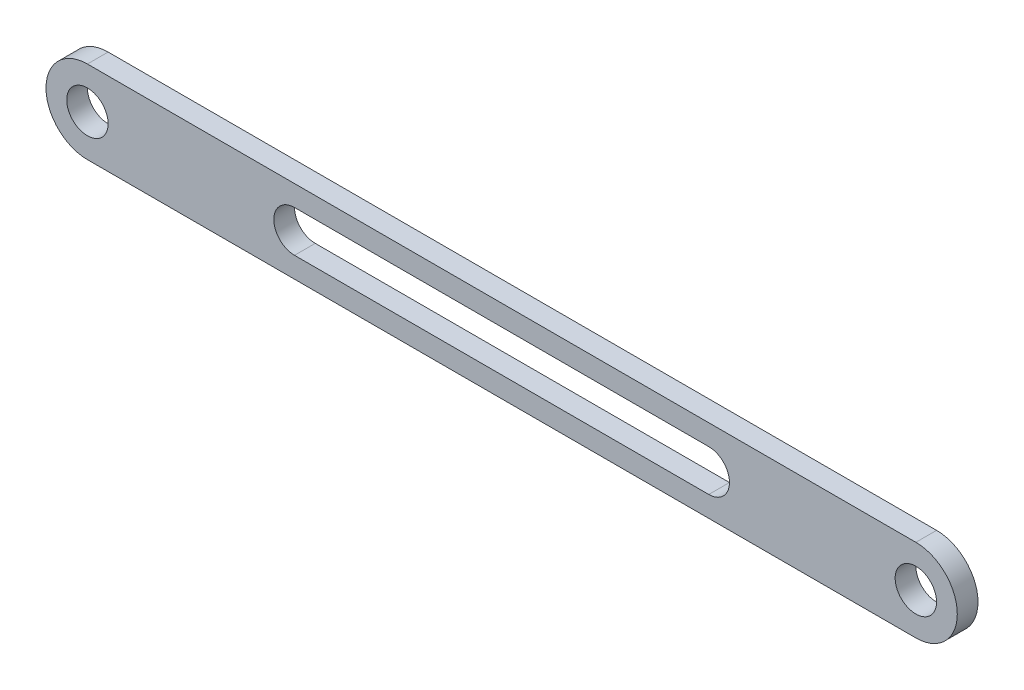
ISO-10303-21;
HEADER;
FILE_DESCRIPTION(('STEP AP214'),'2;1');
FILE_NAME('part.step','',(''),(''),'','','');
FILE_SCHEMA(('AUTOMOTIVE_DESIGN { 1 0 10303 214 1 1 1 1 }'));
ENDSEC;
DATA;
#1=APPLICATION_CONTEXT('core data for automotive mechanical design processes');
#2=APPLICATION_PROTOCOL_DEFINITION('international standard','automotive_design',2000,#1);
#3=PRODUCT_CONTEXT('',#1,'mechanical');
#4=PRODUCT('Part','Part','',(#3));
#5=PRODUCT_RELATED_PRODUCT_CATEGORY('part','',(#4));
#6=PRODUCT_DEFINITION_FORMATION('','',#4);
#7=PRODUCT_DEFINITION_CONTEXT('part definition',#1,'design');
#8=PRODUCT_DEFINITION('design','',#6,#7);
#9=PRODUCT_DEFINITION_SHAPE('','',#8);
#10=(LENGTH_UNIT() NAMED_UNIT(*) SI_UNIT(.MILLI.,.METRE.));
#11=(NAMED_UNIT(*) PLANE_ANGLE_UNIT() SI_UNIT($,.RADIAN.));
#12=(NAMED_UNIT(*) SI_UNIT($,.STERADIAN.) SOLID_ANGLE_UNIT());
#13=UNCERTAINTY_MEASURE_WITH_UNIT(LENGTH_MEASURE(1.E-05),#10,'distance_accuracy_value','');
#14=(GEOMETRIC_REPRESENTATION_CONTEXT(3) GLOBAL_UNCERTAINTY_ASSIGNED_CONTEXT((#13)) GLOBAL_UNIT_ASSIGNED_CONTEXT((#10,
#11,#12)) REPRESENTATION_CONTEXT('',''));
#15=CARTESIAN_POINT('',(0.,0.,0.));
#16=DIRECTION('',(0.,0.,1.));
#17=DIRECTION('',(1.,0.,0.));
#18=AXIS2_PLACEMENT_3D('',#15,#16,#17);
#19=CARTESIAN_POINT('',(-89.5193419963546,0.,10.));
#20=DIRECTION('',(0.,0.,1.));
#21=DIRECTION('',(1.,0.,0.));
#22=AXIS2_PLACEMENT_3D('',#19,#20,#21);
#23=PLANE('',#22);
#24=CARTESIAN_POINT('',(-89.5193419963548,0.,10.));
#25=DIRECTION('',(0.,0.,1.));
#26=DIRECTION('',(1.,0.,0.));
#27=AXIS2_PLACEMENT_3D('',#24,#25,#26);
#28=CIRCLE('',#27,9.99999999999999);
#29=CARTESIAN_POINT('',(-79.5193419963548,0.,10.));
#30=VERTEX_POINT('',#29);
#31=EDGE_CURVE('E135',#30,#30,#28,.T.);
#32=ORIENTED_EDGE('',*,*,#31,.F.);
#33=EDGE_LOOP('',(#32));
#34=FACE_BOUND('',#33,.T.);
#35=CARTESIAN_POINT('',(-89.5193419963546,0.,10.));
#36=DIRECTION('',(0.,0.,1.));
#37=DIRECTION('',(1.,0.,0.));
#38=AXIS2_PLACEMENT_3D('',#35,#36,#37);
#39=CIRCLE('',#38,20.);
#40=CARTESIAN_POINT('',(-89.5193419963546,20.,10.));
#41=VERTEX_POINT('',#40);
#42=CARTESIAN_POINT('',(-89.5193419963546,-20.,10.));
#43=VERTEX_POINT('',#42);
#44=EDGE_CURVE('E145',#41,#43,#39,.T.);
#45=ORIENTED_EDGE('',*,*,#44,.T.);
#46=DIRECTION('',(1.,0.,0.));
#47=VECTOR('',#46,1.);
#48=CARTESIAN_POINT('',(-89.5193419963546,-20.,10.));
#49=LINE('',#48,#47);
#50=CARTESIAN_POINT('',(310.480658003645,-20.,10.));
#51=VERTEX_POINT('',#50);
#52=EDGE_CURVE('E148',#43,#51,#49,.T.);
#53=ORIENTED_EDGE('',*,*,#52,.T.);
#54=CARTESIAN_POINT('',(310.480658003645,0.,10.));
#55=DIRECTION('',(0.,0.,1.));
#56=DIRECTION('',(1.,0.,0.));
#57=AXIS2_PLACEMENT_3D('',#54,#55,#56);
#58=CIRCLE('',#57,20.);
#59=CARTESIAN_POINT('',(310.480658003645,20.0000000000001,10.));
#60=VERTEX_POINT('',#59);
#61=EDGE_CURVE('E151',#51,#60,#58,.T.);
#62=ORIENTED_EDGE('',*,*,#61,.T.);
#63=DIRECTION('',(-1.,0.,0.));
#64=VECTOR('',#63,1.);
#65=CARTESIAN_POINT('',(-89.5193419963546,20.,10.));
#66=LINE('',#65,#64);
#67=EDGE_CURVE('E153',#60,#41,#66,.T.);
#68=ORIENTED_EDGE('',*,*,#67,.T.);
#69=EDGE_LOOP('',(#45,#53,#62,#68));
#70=FACE_BOUND('',#69,.T.);
#71=DIRECTION('',(1.,0.,0.));
#72=VECTOR('',#71,1.);
#73=CARTESIAN_POINT('',(10.4806580036454,-10.,10.));
#74=LINE('',#73,#72);
#75=CARTESIAN_POINT('',(10.4806580036454,-10.,10.));
#76=VERTEX_POINT('',#75);
#77=CARTESIAN_POINT('',(210.480658003645,-10.,10.));
#78=VERTEX_POINT('',#77);
#79=EDGE_CURVE('E114',#76,#78,#74,.T.);
#80=ORIENTED_EDGE('',*,*,#79,.F.);
#81=CARTESIAN_POINT('',(10.4806580036454,0.,10.));
#82=DIRECTION('',(0.,0.,1.));
#83=DIRECTION('',(1.,0.,0.));
#84=AXIS2_PLACEMENT_3D('',#81,#82,#83);
#85=CIRCLE('',#84,10.);
#86=CARTESIAN_POINT('',(10.4806580036454,9.99999999999998,10.));
#87=VERTEX_POINT('',#86);
#88=EDGE_CURVE('E106',#87,#76,#85,.T.);
#89=ORIENTED_EDGE('',*,*,#88,.F.);
#90=DIRECTION('',(-1.,0.,0.));
#91=VECTOR('',#90,1.);
#92=CARTESIAN_POINT('',(10.4806580036454,9.99999999999998,10.));
#93=LINE('',#92,#91);
#94=CARTESIAN_POINT('',(210.480658003645,10.,10.));
#95=VERTEX_POINT('',#94);
#96=EDGE_CURVE('E129',#95,#87,#93,.T.);
#97=ORIENTED_EDGE('',*,*,#96,.F.);
#98=CARTESIAN_POINT('',(210.480658003645,0.,10.));
#99=DIRECTION('',(0.,0.,1.));
#100=DIRECTION('',(1.,0.,0.));
#101=AXIS2_PLACEMENT_3D('',#98,#99,#100);
#102=CIRCLE('',#101,10.);
#103=EDGE_CURVE('E127',#78,#95,#102,.T.);
#104=ORIENTED_EDGE('',*,*,#103,.F.);
#105=EDGE_LOOP('',(#80,#89,#97,#104));
#106=FACE_BOUND('',#105,.T.);
#107=CARTESIAN_POINT('',(310.480658003645,0.,10.));
#108=DIRECTION('',(0.,0.,1.));
#109=DIRECTION('',(1.,0.,0.));
#110=AXIS2_PLACEMENT_3D('',#107,#108,#109);
#111=CIRCLE('',#110,10.);
#112=CARTESIAN_POINT('',(320.480658003645,0.,10.));
#113=VERTEX_POINT('',#112);
#114=EDGE_CURVE('E236',#113,#113,#111,.T.);
#115=ORIENTED_EDGE('',*,*,#114,.F.);
#116=EDGE_LOOP('',(#115));
#117=FACE_BOUND('',#116,.T.);
#118=ADVANCED_FACE('F41',(#34,#70,#106,#117),#23,.T.);
#119=CARTESIAN_POINT('',(-89.5193419963546,0.,0.));
#120=DIRECTION('',(0.,0.,1.));
#121=DIRECTION('',(1.,0.,0.));
#122=AXIS2_PLACEMENT_3D('',#119,#120,#121);
#123=PLANE('',#122);
#124=CARTESIAN_POINT('',(-89.5193419963548,0.,0.));
#125=DIRECTION('',(0.,0.,1.));
#126=DIRECTION('',(1.,0.,0.));
#127=AXIS2_PLACEMENT_3D('',#124,#125,#126);
#128=CIRCLE('',#127,9.99999999999999);
#129=CARTESIAN_POINT('',(-79.5193419963548,0.,0.));
#130=VERTEX_POINT('',#129);
#131=EDGE_CURVE('E242',#130,#130,#128,.T.);
#132=ORIENTED_EDGE('',*,*,#131,.T.);
#133=EDGE_LOOP('',(#132));
#134=FACE_BOUND('',#133,.T.);
#135=CARTESIAN_POINT('',(-89.5193419963546,0.,0.));
#136=DIRECTION('',(0.,0.,1.));
#137=DIRECTION('',(1.,0.,0.));
#138=AXIS2_PLACEMENT_3D('',#135,#136,#137);
#139=CIRCLE('',#138,20.);
#140=CARTESIAN_POINT('',(-89.5193419963546,20.,0.));
#141=VERTEX_POINT('',#140);
#142=CARTESIAN_POINT('',(-89.5193419963546,-20.,0.));
#143=VERTEX_POINT('',#142);
#144=EDGE_CURVE('E122',#141,#143,#139,.T.);
#145=ORIENTED_EDGE('',*,*,#144,.F.);
#146=DIRECTION('',(-1.,0.,0.));
#147=VECTOR('',#146,1.);
#148=CARTESIAN_POINT('',(-89.5193419963546,20.,0.));
#149=LINE('',#148,#147);
#150=CARTESIAN_POINT('',(310.480658003645,20.0000000000001,0.));
#151=VERTEX_POINT('',#150);
#152=EDGE_CURVE('E149',#151,#141,#149,.T.);
#153=ORIENTED_EDGE('',*,*,#152,.F.);
#154=CARTESIAN_POINT('',(310.480658003645,0.,0.));
#155=DIRECTION('',(0.,0.,1.));
#156=DIRECTION('',(1.,0.,0.));
#157=AXIS2_PLACEMENT_3D('',#154,#155,#156);
#158=CIRCLE('',#157,20.);
#159=CARTESIAN_POINT('',(310.480658003645,-20.,0.));
#160=VERTEX_POINT('',#159);
#161=EDGE_CURVE('E160',#160,#151,#158,.T.);
#162=ORIENTED_EDGE('',*,*,#161,.F.);
#163=DIRECTION('',(1.,0.,0.));
#164=VECTOR('',#163,1.);
#165=CARTESIAN_POINT('',(-89.5193419963546,-20.,0.));
#166=LINE('',#165,#164);
#167=EDGE_CURVE('E158',#143,#160,#166,.T.);
#168=ORIENTED_EDGE('',*,*,#167,.F.);
#169=EDGE_LOOP('',(#145,#153,#162,#168));
#170=FACE_BOUND('',#169,.T.);
#171=CARTESIAN_POINT('',(10.4806580036454,0.,0.));
#172=DIRECTION('',(0.,0.,1.));
#173=DIRECTION('',(1.,0.,0.));
#174=AXIS2_PLACEMENT_3D('',#171,#172,#173);
#175=CIRCLE('',#174,10.);
#176=CARTESIAN_POINT('',(10.4806580036454,9.99999999999998,0.));
#177=VERTEX_POINT('',#176);
#178=CARTESIAN_POINT('',(10.4806580036454,-10.,0.));
#179=VERTEX_POINT('',#178);
#180=EDGE_CURVE('E64',#177,#179,#175,.T.);
#181=ORIENTED_EDGE('',*,*,#180,.T.);
#182=DIRECTION('',(1.,0.,0.));
#183=VECTOR('',#182,1.);
#184=CARTESIAN_POINT('',(10.4806580036454,-10.,0.));
#185=LINE('',#184,#183);
#186=CARTESIAN_POINT('',(210.480658003645,-10.,0.));
#187=VERTEX_POINT('',#186);
#188=EDGE_CURVE('E121',#179,#187,#185,.T.);
#189=ORIENTED_EDGE('',*,*,#188,.T.);
#190=CARTESIAN_POINT('',(210.480658003645,0.,0.));
#191=DIRECTION('',(0.,0.,1.));
#192=DIRECTION('',(1.,0.,0.));
#193=AXIS2_PLACEMENT_3D('',#190,#191,#192);
#194=CIRCLE('',#193,10.);
#195=CARTESIAN_POINT('',(210.480658003645,10.,0.));
#196=VERTEX_POINT('',#195);
#197=EDGE_CURVE('E137',#187,#196,#194,.T.);
#198=ORIENTED_EDGE('',*,*,#197,.T.);
#199=DIRECTION('',(-1.,0.,0.));
#200=VECTOR('',#199,1.);
#201=CARTESIAN_POINT('',(10.4806580036454,9.99999999999998,0.));
#202=LINE('',#201,#200);
#203=EDGE_CURVE('E115',#196,#177,#202,.T.);
#204=ORIENTED_EDGE('',*,*,#203,.T.);
#205=EDGE_LOOP('',(#181,#189,#198,#204));
#206=FACE_BOUND('',#205,.T.);
#207=CARTESIAN_POINT('',(310.480658003645,0.,0.));
#208=DIRECTION('',(0.,0.,1.));
#209=DIRECTION('',(1.,0.,0.));
#210=AXIS2_PLACEMENT_3D('',#207,#208,#209);
#211=CIRCLE('',#210,10.);
#212=CARTESIAN_POINT('',(320.480658003645,0.,0.));
#213=VERTEX_POINT('',#212);
#214=EDGE_CURVE('E239',#213,#213,#211,.T.);
#215=ORIENTED_EDGE('',*,*,#214,.T.);
#216=EDGE_LOOP('',(#215));
#217=FACE_BOUND('',#216,.T.);
#218=ADVANCED_FACE('F178',(#134,#170,#206,#217),#123,.F.);
#219=CARTESIAN_POINT('',(-89.5193419963546,0.,10.));
#220=DIRECTION('',(0.,0.,-1.));
#221=DIRECTION('',(-1.,0.,0.));
#222=AXIS2_PLACEMENT_3D('',#219,#220,#221);
#223=CYLINDRICAL_SURFACE('',#222,20.);
#224=ORIENTED_EDGE('',*,*,#144,.T.);
#225=DIRECTION('',(0.,0.,-1.));
#226=VECTOR('',#225,1.);
#227=CARTESIAN_POINT('',(-89.5193419963546,-20.,10.));
#228=LINE('',#227,#226);
#229=EDGE_CURVE('E13',#43,#143,#228,.T.);
#230=ORIENTED_EDGE('',*,*,#229,.F.);
#231=ORIENTED_EDGE('',*,*,#44,.F.);
#232=DIRECTION('',(0.,0.,-1.));
#233=VECTOR('',#232,1.);
#234=CARTESIAN_POINT('',(-89.5193419963546,20.,10.));
#235=LINE('',#234,#233);
#236=EDGE_CURVE('E155',#41,#141,#235,.T.);
#237=ORIENTED_EDGE('',*,*,#236,.T.);
#238=EDGE_LOOP('',(#224,#230,#231,#237));
#239=FACE_BOUND('',#238,.T.);
#240=ADVANCED_FACE('F43',(#239),#223,.T.);
#241=CARTESIAN_POINT('',(-89.5193419963546,-20.,10.));
#242=DIRECTION('',(0.,1.,0.));
#243=DIRECTION('',(-1.,0.,0.));
#244=AXIS2_PLACEMENT_3D('',#241,#242,#243);
#245=PLANE('',#244);
#246=ORIENTED_EDGE('',*,*,#167,.T.);
#247=DIRECTION('',(0.,0.,-1.));
#248=VECTOR('',#247,1.);
#249=CARTESIAN_POINT('',(310.480658003645,-20.,10.));
#250=LINE('',#249,#248);
#251=EDGE_CURVE('E49',#51,#160,#250,.T.);
#252=ORIENTED_EDGE('',*,*,#251,.F.);
#253=ORIENTED_EDGE('',*,*,#52,.F.);
#254=ORIENTED_EDGE('',*,*,#229,.T.);
#255=EDGE_LOOP('',(#246,#252,#253,#254));
#256=FACE_BOUND('',#255,.T.);
#257=ADVANCED_FACE('F188',(#256),#245,.F.);
#258=CARTESIAN_POINT('',(310.480658003645,0.,10.));
#259=DIRECTION('',(0.,0.,-1.));
#260=DIRECTION('',(-1.,0.,0.));
#261=AXIS2_PLACEMENT_3D('',#258,#259,#260);
#262=CYLINDRICAL_SURFACE('',#261,20.);
#263=ORIENTED_EDGE('',*,*,#161,.T.);
#264=DIRECTION('',(0.,0.,-1.));
#265=VECTOR('',#264,1.);
#266=CARTESIAN_POINT('',(310.480658003645,20.0000000000001,10.));
#267=LINE('',#266,#265);
#268=EDGE_CURVE('E165',#60,#151,#267,.T.);
#269=ORIENTED_EDGE('',*,*,#268,.F.);
#270=ORIENTED_EDGE('',*,*,#61,.F.);
#271=ORIENTED_EDGE('',*,*,#251,.T.);
#272=EDGE_LOOP('',(#263,#269,#270,#271));
#273=FACE_BOUND('',#272,.T.);
#274=ADVANCED_FACE('F172',(#273),#262,.T.);
#275=CARTESIAN_POINT('',(-89.5193419963546,20.,10.));
#276=DIRECTION('',(0.,-1.,0.));
#277=DIRECTION('',(1.,0.,0.));
#278=AXIS2_PLACEMENT_3D('',#275,#276,#277);
#279=PLANE('',#278);
#280=ORIENTED_EDGE('',*,*,#152,.T.);
#281=ORIENTED_EDGE('',*,*,#236,.F.);
#282=ORIENTED_EDGE('',*,*,#67,.F.);
#283=ORIENTED_EDGE('',*,*,#268,.T.);
#284=EDGE_LOOP('',(#280,#281,#282,#283));
#285=FACE_BOUND('',#284,.T.);
#286=ADVANCED_FACE('F182',(#285),#279,.F.);
#287=CARTESIAN_POINT('',(10.4806580036454,0.,10.));
#288=DIRECTION('',(0.,0.,-1.));
#289=DIRECTION('',(-1.,0.,0.));
#290=AXIS2_PLACEMENT_3D('',#287,#288,#289);
#291=CYLINDRICAL_SURFACE('',#290,10.);
#292=ORIENTED_EDGE('',*,*,#180,.F.);
#293=DIRECTION('',(0.,0.,-1.));
#294=VECTOR('',#293,1.);
#295=CARTESIAN_POINT('',(10.4806580036454,9.99999999999998,10.));
#296=LINE('',#295,#294);
#297=EDGE_CURVE('E110',#87,#177,#296,.T.);
#298=ORIENTED_EDGE('',*,*,#297,.F.);
#299=ORIENTED_EDGE('',*,*,#88,.T.);
#300=DIRECTION('',(0.,0.,-1.));
#301=VECTOR('',#300,1.);
#302=CARTESIAN_POINT('',(10.4806580036454,-10.,10.));
#303=LINE('',#302,#301);
#304=EDGE_CURVE('E109',#76,#179,#303,.T.);
#305=ORIENTED_EDGE('',*,*,#304,.T.);
#306=EDGE_LOOP('',(#292,#298,#299,#305));
#307=FACE_BOUND('',#306,.T.);
#308=ADVANCED_FACE('F108',(#307),#291,.F.);
#309=CARTESIAN_POINT('',(10.4806580036454,-10.,10.));
#310=DIRECTION('',(0.,1.,0.));
#311=DIRECTION('',(-1.,0.,0.));
#312=AXIS2_PLACEMENT_3D('',#309,#310,#311);
#313=PLANE('',#312);
#314=ORIENTED_EDGE('',*,*,#188,.F.);
#315=ORIENTED_EDGE('',*,*,#304,.F.);
#316=ORIENTED_EDGE('',*,*,#79,.T.);
#317=DIRECTION('',(0.,0.,-1.));
#318=VECTOR('',#317,1.);
#319=CARTESIAN_POINT('',(210.480658003645,-10.,10.));
#320=LINE('',#319,#318);
#321=EDGE_CURVE('E123',#78,#187,#320,.T.);
#322=ORIENTED_EDGE('',*,*,#321,.T.);
#323=EDGE_LOOP('',(#314,#315,#316,#322));
#324=FACE_BOUND('',#323,.T.);
#325=ADVANCED_FACE('F118',(#324),#313,.T.);
#326=CARTESIAN_POINT('',(210.480658003645,0.,10.));
#327=DIRECTION('',(0.,0.,-1.));
#328=DIRECTION('',(-1.,0.,0.));
#329=AXIS2_PLACEMENT_3D('',#326,#327,#328);
#330=CYLINDRICAL_SURFACE('',#329,10.);
#331=ORIENTED_EDGE('',*,*,#197,.F.);
#332=ORIENTED_EDGE('',*,*,#321,.F.);
#333=ORIENTED_EDGE('',*,*,#103,.T.);
#334=DIRECTION('',(0.,0.,-1.));
#335=VECTOR('',#334,1.);
#336=CARTESIAN_POINT('',(210.480658003645,10.,10.));
#337=LINE('',#336,#335);
#338=EDGE_CURVE('E56',#95,#196,#337,.T.);
#339=ORIENTED_EDGE('',*,*,#338,.T.);
#340=EDGE_LOOP('',(#331,#332,#333,#339));
#341=FACE_BOUND('',#340,.T.);
#342=ADVANCED_FACE('F214',(#341),#330,.F.);
#343=CARTESIAN_POINT('',(10.4806580036454,9.99999999999998,10.));
#344=DIRECTION('',(0.,-1.,0.));
#345=DIRECTION('',(1.,0.,0.));
#346=AXIS2_PLACEMENT_3D('',#343,#344,#345);
#347=PLANE('',#346);
#348=ORIENTED_EDGE('',*,*,#203,.F.);
#349=ORIENTED_EDGE('',*,*,#338,.F.);
#350=ORIENTED_EDGE('',*,*,#96,.T.);
#351=ORIENTED_EDGE('',*,*,#297,.T.);
#352=EDGE_LOOP('',(#348,#349,#350,#351));
#353=FACE_BOUND('',#352,.T.);
#354=ADVANCED_FACE('F218',(#353),#347,.T.);
#355=CARTESIAN_POINT('',(-89.5193419963548,0.,10.));
#356=DIRECTION('',(0.,0.,-1.));
#357=DIRECTION('',(-1.,0.,0.));
#358=AXIS2_PLACEMENT_3D('',#355,#356,#357);
#359=CYLINDRICAL_SURFACE('',#358,9.99999999999999);
#360=ORIENTED_EDGE('',*,*,#31,.T.);
#361=EDGE_LOOP('',(#360));
#362=FACE_BOUND('',#361,.T.);
#363=ORIENTED_EDGE('',*,*,#131,.F.);
#364=EDGE_LOOP('',(#363));
#365=FACE_BOUND('',#364,.T.);
#366=ADVANCED_FACE('F224',(#362,#365),#359,.F.);
#367=CARTESIAN_POINT('',(310.480658003645,0.,10.));
#368=DIRECTION('',(0.,0.,-1.));
#369=DIRECTION('',(-1.,0.,0.));
#370=AXIS2_PLACEMENT_3D('',#367,#368,#369);
#371=CYLINDRICAL_SURFACE('',#370,10.);
#372=ORIENTED_EDGE('',*,*,#114,.T.);
#373=EDGE_LOOP('',(#372));
#374=FACE_BOUND('',#373,.T.);
#375=ORIENTED_EDGE('',*,*,#214,.F.);
#376=EDGE_LOOP('',(#375));
#377=FACE_BOUND('',#376,.T.);
#378=ADVANCED_FACE('F227',(#374,#377),#371,.F.);
#379=CLOSED_SHELL('',(#118,#218,#240,#257,#274,#286,#308,#325,#342,#354,#366,#378));
#380=MANIFOLD_SOLID_BREP('B2',#379);
#381=ADVANCED_BREP_SHAPE_REPRESENTATION('',(#18,#380),#14);
#382=SHAPE_DEFINITION_REPRESENTATION(#9,#381);
ENDSEC;
END-ISO-10303-21;
